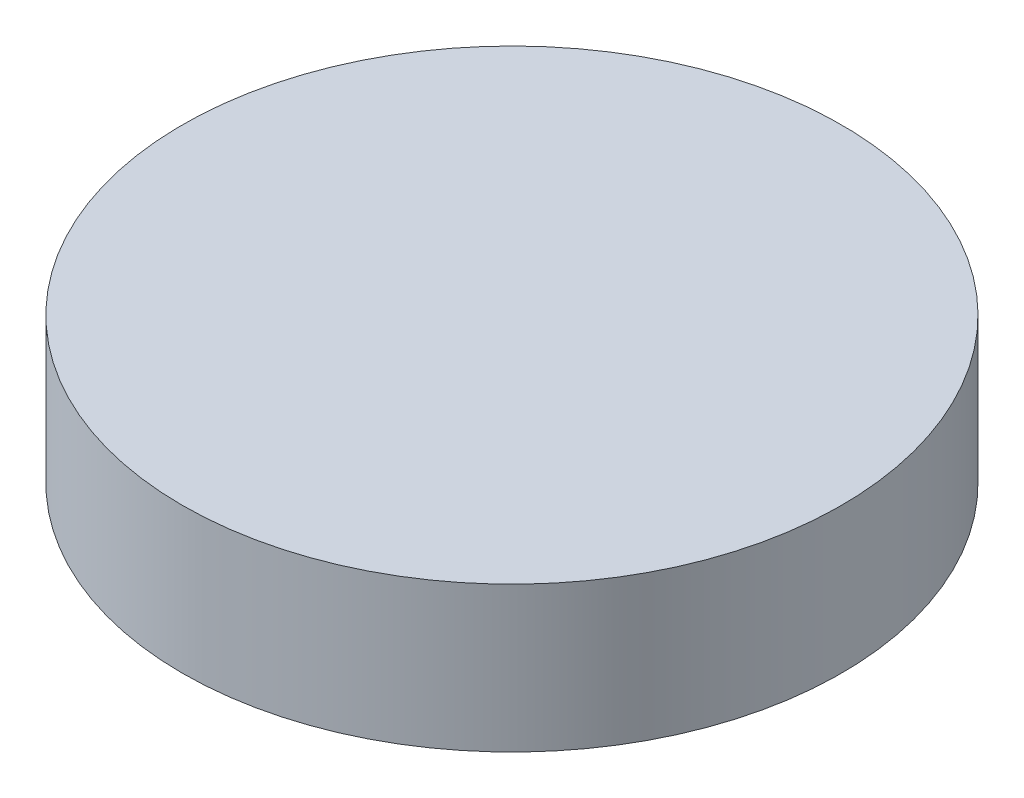
ISO-10303-21;
HEADER;
FILE_DESCRIPTION(('STEP AP214'),'2;1');
FILE_NAME('part.step','',(''),(''),'','','');
FILE_SCHEMA(('AUTOMOTIVE_DESIGN { 1 0 10303 214 1 1 1 1 }'));
ENDSEC;
DATA;
#1=APPLICATION_CONTEXT('core data for automotive mechanical design processes');
#2=APPLICATION_PROTOCOL_DEFINITION('international standard','automotive_design',2000,#1);
#3=PRODUCT_CONTEXT('',#1,'mechanical');
#4=PRODUCT('Part','Part','',(#3));
#5=PRODUCT_RELATED_PRODUCT_CATEGORY('part','',(#4));
#6=PRODUCT_DEFINITION_FORMATION('','',#4);
#7=PRODUCT_DEFINITION_CONTEXT('part definition',#1,'design');
#8=PRODUCT_DEFINITION('design','',#6,#7);
#9=PRODUCT_DEFINITION_SHAPE('','',#8);
#10=(LENGTH_UNIT() NAMED_UNIT(*) SI_UNIT(.MILLI.,.METRE.));
#11=(NAMED_UNIT(*) PLANE_ANGLE_UNIT() SI_UNIT($,.RADIAN.));
#12=(NAMED_UNIT(*) SI_UNIT($,.STERADIAN.) SOLID_ANGLE_UNIT());
#13=UNCERTAINTY_MEASURE_WITH_UNIT(LENGTH_MEASURE(1.E-05),#10,'distance_accuracy_value','');
#14=(GEOMETRIC_REPRESENTATION_CONTEXT(3) GLOBAL_UNCERTAINTY_ASSIGNED_CONTEXT((#13)) GLOBAL_UNIT_ASSIGNED_CONTEXT((#10,
#11,#12)) REPRESENTATION_CONTEXT('',''));
#15=CARTESIAN_POINT('',(0.,0.,0.));
#16=DIRECTION('',(0.,0.,1.));
#17=DIRECTION('',(1.,0.,0.));
#18=AXIS2_PLACEMENT_3D('',#15,#16,#17);
#19=CARTESIAN_POINT('',(0.,15.,0.));
#20=DIRECTION('',(0.,-1.,0.));
#21=DIRECTION('',(0.,0.,-1.));
#22=AXIS2_PLACEMENT_3D('',#19,#20,#21);
#23=CYLINDRICAL_SURFACE('',#22,34.);
#24=CARTESIAN_POINT('',(0.,15.,0.));
#25=DIRECTION('',(0.,1.,0.));
#26=DIRECTION('',(0.,0.,1.));
#27=AXIS2_PLACEMENT_3D('',#24,#25,#26);
#28=CIRCLE('',#27,34.);
#29=CARTESIAN_POINT('',(0.,15.,34.));
#30=VERTEX_POINT('',#29);
#31=EDGE_CURVE('E10',#30,#30,#28,.T.);
#32=ORIENTED_EDGE('',*,*,#31,.F.);
#33=EDGE_LOOP('',(#32));
#34=FACE_BOUND('',#33,.T.);
#35=CARTESIAN_POINT('',(0.,0.,0.));
#36=DIRECTION('',(0.,1.,0.));
#37=DIRECTION('',(0.,0.,1.));
#38=AXIS2_PLACEMENT_3D('',#35,#36,#37);
#39=CIRCLE('',#38,34.);
#40=CARTESIAN_POINT('',(0.,0.,34.));
#41=VERTEX_POINT('',#40);
#42=EDGE_CURVE('E40',#41,#41,#39,.T.);
#43=ORIENTED_EDGE('',*,*,#42,.T.);
#44=EDGE_LOOP('',(#43));
#45=FACE_BOUND('',#44,.T.);
#46=ADVANCED_FACE('F37',(#34,#45),#23,.T.);
#47=CARTESIAN_POINT('',(0.,15.,0.));
#48=DIRECTION('',(0.,1.,0.));
#49=DIRECTION('',(0.,0.,1.));
#50=AXIS2_PLACEMENT_3D('',#47,#48,#49);
#51=PLANE('',#50);
#52=ORIENTED_EDGE('',*,*,#31,.T.);
#53=EDGE_LOOP('',(#52));
#54=FACE_BOUND('',#53,.T.);
#55=ADVANCED_FACE('F70',(#54),#51,.T.);
#56=CARTESIAN_POINT('',(0.,0.,0.));
#57=DIRECTION('',(0.,1.,0.));
#58=DIRECTION('',(0.,0.,1.));
#59=AXIS2_PLACEMENT_3D('',#56,#57,#58);
#60=PLANE('',#59);
#61=CARTESIAN_POINT('',(12.,0.,0.));
#62=DIRECTION('',(0.,-1.,0.));
#63=DIRECTION('',(0.,0.,-1.));
#64=AXIS2_PLACEMENT_3D('',#61,#62,#63);
#65=CIRCLE('',#64,3.);
#66=CARTESIAN_POINT('',(12.,0.,-3.));
#67=VERTEX_POINT('',#66);
#68=EDGE_CURVE('E51',#67,#67,#65,.T.);
#69=ORIENTED_EDGE('',*,*,#68,.F.);
#70=EDGE_LOOP('',(#69));
#71=FACE_BOUND('',#70,.T.);
#72=ORIENTED_EDGE('',*,*,#42,.F.);
#73=EDGE_LOOP('',(#72));
#74=FACE_BOUND('',#73,.T.);
#75=ADVANCED_FACE('F64',(#71,#74),#60,.F.);
#76=CARTESIAN_POINT('',(12.,10.,0.));
#77=DIRECTION('',(0.,-1.,0.));
#78=DIRECTION('',(0.,0.,-1.));
#79=AXIS2_PLACEMENT_3D('',#76,#77,#78);
#80=CYLINDRICAL_SURFACE('',#79,3.);
#81=CARTESIAN_POINT('',(12.,10.,0.));
#82=DIRECTION('',(0.,-1.,0.));
#83=DIRECTION('',(0.,0.,-1.));
#84=AXIS2_PLACEMENT_3D('',#81,#82,#83);
#85=CIRCLE('',#84,3.);
#86=CARTESIAN_POINT('',(12.,10.,-3.));
#87=VERTEX_POINT('',#86);
#88=EDGE_CURVE('E49',#87,#87,#85,.T.);
#89=ORIENTED_EDGE('',*,*,#88,.F.);
#90=EDGE_LOOP('',(#89));
#91=FACE_BOUND('',#90,.T.);
#92=ORIENTED_EDGE('',*,*,#68,.T.);
#93=EDGE_LOOP('',(#92));
#94=FACE_BOUND('',#93,.T.);
#95=ADVANCED_FACE('F61',(#91,#94),#80,.F.);
#96=CARTESIAN_POINT('',(12.,10.,0.));
#97=DIRECTION('',(0.,-1.,0.));
#98=DIRECTION('',(0.,0.,-1.));
#99=AXIS2_PLACEMENT_3D('',#96,#97,#98);
#100=PLANE('',#99);
#101=ORIENTED_EDGE('',*,*,#88,.T.);
#102=EDGE_LOOP('',(#101));
#103=FACE_BOUND('',#102,.T.);
#104=ADVANCED_FACE('F59',(#103),#100,.T.);
#105=CLOSED_SHELL('',(#46,#55,#75,#95,#104));
#106=MANIFOLD_SOLID_BREP('B2',#105);
#107=ADVANCED_BREP_SHAPE_REPRESENTATION('',(#18,#106),#14);
#108=SHAPE_DEFINITION_REPRESENTATION(#9,#107);
ENDSEC;
END-ISO-10303-21;
